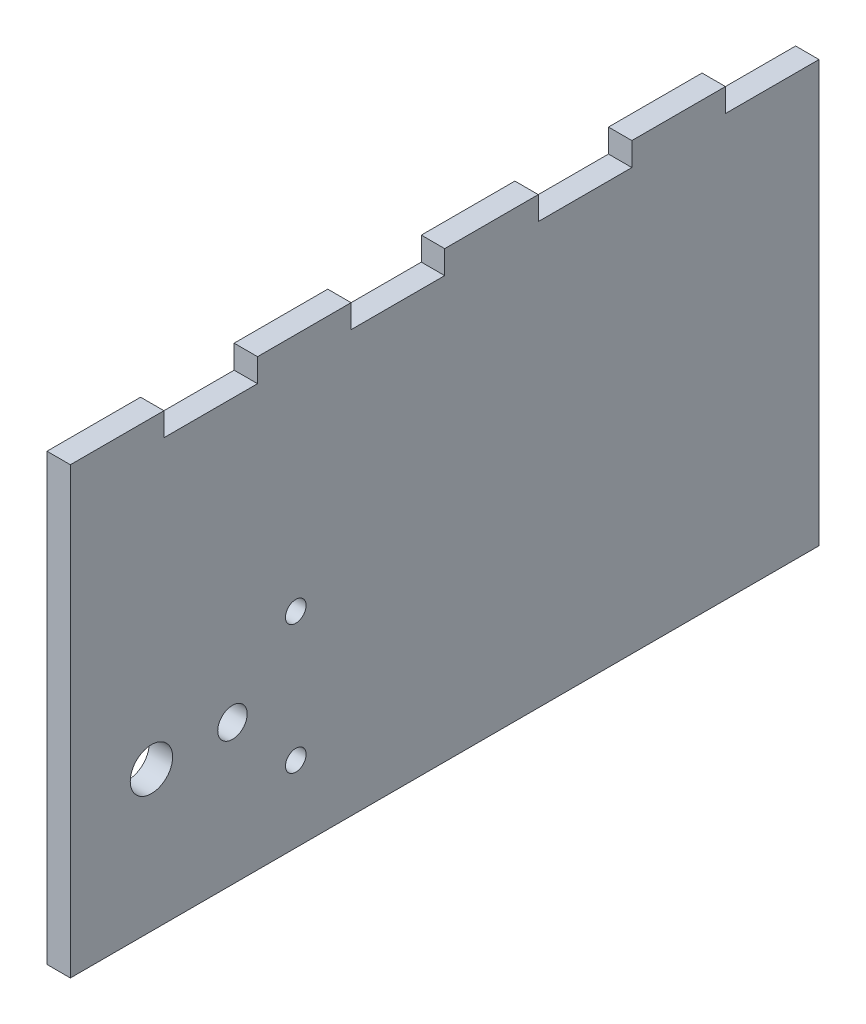
ISO-10303-21;
HEADER;
FILE_DESCRIPTION(('STEP AP214'),'2;1');
FILE_NAME('part.step','',(''),(''),'','','');
FILE_SCHEMA(('AUTOMOTIVE_DESIGN { 1 0 10303 214 1 1 1 1 }'));
ENDSEC;
DATA;
#1=APPLICATION_CONTEXT('core data for automotive mechanical design processes');
#2=APPLICATION_PROTOCOL_DEFINITION('international standard','automotive_design',2000,#1);
#3=PRODUCT_CONTEXT('',#1,'mechanical');
#4=PRODUCT('Part','Part','',(#3));
#5=PRODUCT_RELATED_PRODUCT_CATEGORY('part','',(#4));
#6=PRODUCT_DEFINITION_FORMATION('','',#4);
#7=PRODUCT_DEFINITION_CONTEXT('part definition',#1,'design');
#8=PRODUCT_DEFINITION('design','',#6,#7);
#9=PRODUCT_DEFINITION_SHAPE('','',#8);
#10=(LENGTH_UNIT() NAMED_UNIT(*) SI_UNIT(.MILLI.,.METRE.));
#11=(NAMED_UNIT(*) PLANE_ANGLE_UNIT() SI_UNIT($,.RADIAN.));
#12=(NAMED_UNIT(*) SI_UNIT($,.STERADIAN.) SOLID_ANGLE_UNIT());
#13=UNCERTAINTY_MEASURE_WITH_UNIT(LENGTH_MEASURE(1.E-05),#10,'distance_accuracy_value','');
#14=(GEOMETRIC_REPRESENTATION_CONTEXT(3) GLOBAL_UNCERTAINTY_ASSIGNED_CONTEXT((#13)) GLOBAL_UNIT_ASSIGNED_CONTEXT((#10,
#11,#12)) REPRESENTATION_CONTEXT('',''));
#15=CARTESIAN_POINT('',(0.,0.,0.));
#16=DIRECTION('',(0.,0.,1.));
#17=DIRECTION('',(1.,0.,0.));
#18=AXIS2_PLACEMENT_3D('',#15,#16,#17);
#19=CARTESIAN_POINT('',(3.175,0.,-101.6));
#20=DIRECTION('',(0.,1.,0.));
#21=DIRECTION('',(0.,0.,1.));
#22=AXIS2_PLACEMENT_3D('',#19,#20,#21);
#23=PLANE('',#22);
#24=DIRECTION('',(0.,0.,-1.));
#25=VECTOR('',#24,1.);
#26=CARTESIAN_POINT('',(0.,0.,-101.6));
#27=LINE('',#26,#25);
#28=CARTESIAN_POINT('',(0.,0.,0.));
#29=VERTEX_POINT('',#28);
#30=CARTESIAN_POINT('',(0.,0.,-101.6));
#31=VERTEX_POINT('',#30);
#32=EDGE_CURVE('E190',#29,#31,#27,.T.);
#33=ORIENTED_EDGE('',*,*,#32,.T.);
#34=DIRECTION('',(-1.,0.,0.));
#35=VECTOR('',#34,1.);
#36=CARTESIAN_POINT('',(3.175,0.,-101.6));
#37=LINE('',#36,#35);
#38=CARTESIAN_POINT('',(3.175,0.,-101.6));
#39=VERTEX_POINT('',#38);
#40=EDGE_CURVE('E11',#39,#31,#37,.T.);
#41=ORIENTED_EDGE('',*,*,#40,.F.);
#42=DIRECTION('',(0.,0.,-1.));
#43=VECTOR('',#42,1.);
#44=CARTESIAN_POINT('',(3.175,0.,-101.6));
#45=LINE('',#44,#43);
#46=CARTESIAN_POINT('',(3.175,0.,0.));
#47=VERTEX_POINT('',#46);
#48=EDGE_CURVE('E225',#47,#39,#45,.T.);
#49=ORIENTED_EDGE('',*,*,#48,.F.);
#50=DIRECTION('',(-1.,0.,0.));
#51=VECTOR('',#50,1.);
#52=CARTESIAN_POINT('',(3.175,0.,0.));
#53=LINE('',#52,#51);
#54=EDGE_CURVE('E186',#47,#29,#53,.T.);
#55=ORIENTED_EDGE('',*,*,#54,.T.);
#56=EDGE_LOOP('',(#33,#41,#49,#55));
#57=FACE_BOUND('',#56,.T.);
#58=ADVANCED_FACE('F34',(#57),#23,.F.);
#59=CARTESIAN_POINT('',(3.175,57.15,-101.6));
#60=DIRECTION('',(0.,0.,1.));
#61=DIRECTION('',(0.,-1.,0.));
#62=AXIS2_PLACEMENT_3D('',#59,#60,#61);
#63=PLANE('',#62);
#64=DIRECTION('',(0.,1.,0.));
#65=VECTOR('',#64,1.);
#66=CARTESIAN_POINT('',(0.,57.15,-101.6));
#67=LINE('',#66,#65);
#68=CARTESIAN_POINT('',(0.,57.15,-101.6));
#69=VERTEX_POINT('',#68);
#70=EDGE_CURVE('E193',#31,#69,#67,.T.);
#71=ORIENTED_EDGE('',*,*,#70,.T.);
#72=DIRECTION('',(-1.,0.,0.));
#73=VECTOR('',#72,1.);
#74=CARTESIAN_POINT('',(3.175,57.15,-101.6));
#75=LINE('',#74,#73);
#76=CARTESIAN_POINT('',(3.175,57.15,-101.6));
#77=VERTEX_POINT('',#76);
#78=EDGE_CURVE('E42',#77,#69,#75,.T.);
#79=ORIENTED_EDGE('',*,*,#78,.F.);
#80=DIRECTION('',(0.,1.,0.));
#81=VECTOR('',#80,1.);
#82=CARTESIAN_POINT('',(3.175,57.15,-101.6));
#83=LINE('',#82,#81);
#84=EDGE_CURVE('E123',#39,#77,#83,.T.);
#85=ORIENTED_EDGE('',*,*,#84,.F.);
#86=ORIENTED_EDGE('',*,*,#40,.T.);
#87=EDGE_LOOP('',(#71,#79,#85,#86));
#88=FACE_BOUND('',#87,.T.);
#89=ADVANCED_FACE('F335',(#88),#63,.F.);
#90=CARTESIAN_POINT('',(3.175,57.15,-88.9));
#91=DIRECTION('',(0.,-1.,0.));
#92=DIRECTION('',(0.,0.,-1.));
#93=AXIS2_PLACEMENT_3D('',#90,#91,#92);
#94=PLANE('',#93);
#95=DIRECTION('',(0.,0.,1.));
#96=VECTOR('',#95,1.);
#97=CARTESIAN_POINT('',(0.,57.15,-88.9));
#98=LINE('',#97,#96);
#99=CARTESIAN_POINT('',(0.,57.15,-88.9));
#100=VERTEX_POINT('',#99);
#101=EDGE_CURVE('E196',#69,#100,#98,.T.);
#102=ORIENTED_EDGE('',*,*,#101,.T.);
#103=DIRECTION('',(-1.,0.,0.));
#104=VECTOR('',#103,1.);
#105=CARTESIAN_POINT('',(3.175,57.15,-88.9));
#106=LINE('',#105,#104);
#107=CARTESIAN_POINT('',(3.175,57.15,-88.9));
#108=VERTEX_POINT('',#107);
#109=EDGE_CURVE('E262',#108,#100,#106,.T.);
#110=ORIENTED_EDGE('',*,*,#109,.F.);
#111=DIRECTION('',(0.,0.,1.));
#112=VECTOR('',#111,1.);
#113=CARTESIAN_POINT('',(3.175,57.15,-88.9));
#114=LINE('',#113,#112);
#115=EDGE_CURVE('E270',#77,#108,#114,.T.);
#116=ORIENTED_EDGE('',*,*,#115,.F.);
#117=ORIENTED_EDGE('',*,*,#78,.T.);
#118=EDGE_LOOP('',(#102,#110,#116,#117));
#119=FACE_BOUND('',#118,.T.);
#120=ADVANCED_FACE('F268',(#119),#94,.F.);
#121=CARTESIAN_POINT('',(3.175,60.325,-88.9));
#122=DIRECTION('',(0.,0.,1.));
#123=DIRECTION('',(1.,0.,0.));
#124=AXIS2_PLACEMENT_3D('',#121,#122,#123);
#125=PLANE('',#124);
#126=DIRECTION('',(0.,1.,0.));
#127=VECTOR('',#126,1.);
#128=CARTESIAN_POINT('',(0.,60.325,-88.9));
#129=LINE('',#128,#127);
#130=CARTESIAN_POINT('',(0.,60.325,-88.9));
#131=VERTEX_POINT('',#130);
#132=EDGE_CURVE('E198',#100,#131,#129,.T.);
#133=ORIENTED_EDGE('',*,*,#132,.T.);
#134=DIRECTION('',(-1.,0.,0.));
#135=VECTOR('',#134,1.);
#136=CARTESIAN_POINT('',(3.175,60.325,-88.9));
#137=LINE('',#136,#135);
#138=CARTESIAN_POINT('',(3.175,60.325,-88.9));
#139=VERTEX_POINT('',#138);
#140=EDGE_CURVE('E259',#139,#131,#137,.T.);
#141=ORIENTED_EDGE('',*,*,#140,.F.);
#142=DIRECTION('',(0.,1.,0.));
#143=VECTOR('',#142,1.);
#144=CARTESIAN_POINT('',(3.175,60.325,-88.9));
#145=LINE('',#144,#143);
#146=EDGE_CURVE('E288',#108,#139,#145,.T.);
#147=ORIENTED_EDGE('',*,*,#146,.F.);
#148=ORIENTED_EDGE('',*,*,#109,.T.);
#149=EDGE_LOOP('',(#133,#141,#147,#148));
#150=FACE_BOUND('',#149,.T.);
#151=ADVANCED_FACE('F279',(#150),#125,.F.);
#152=CARTESIAN_POINT('',(3.175,60.325,-76.2));
#153=DIRECTION('',(0.,-1.,0.));
#154=DIRECTION('',(0.,0.,-1.));
#155=AXIS2_PLACEMENT_3D('',#152,#153,#154);
#156=PLANE('',#155);
#157=DIRECTION('',(0.,0.,1.));
#158=VECTOR('',#157,1.);
#159=CARTESIAN_POINT('',(0.,60.325,-76.2));
#160=LINE('',#159,#158);
#161=CARTESIAN_POINT('',(0.,60.325,-76.2));
#162=VERTEX_POINT('',#161);
#163=EDGE_CURVE('E200',#131,#162,#160,.T.);
#164=ORIENTED_EDGE('',*,*,#163,.T.);
#165=DIRECTION('',(-1.,0.,0.));
#166=VECTOR('',#165,1.);
#167=CARTESIAN_POINT('',(3.175,60.325,-76.2));
#168=LINE('',#167,#166);
#169=CARTESIAN_POINT('',(3.175,60.325,-76.2));
#170=VERTEX_POINT('',#169);
#171=EDGE_CURVE('E256',#170,#162,#168,.T.);
#172=ORIENTED_EDGE('',*,*,#171,.F.);
#173=DIRECTION('',(0.,0.,1.));
#174=VECTOR('',#173,1.);
#175=CARTESIAN_POINT('',(3.175,60.325,-76.2));
#176=LINE('',#175,#174);
#177=EDGE_CURVE('E285',#139,#170,#176,.T.);
#178=ORIENTED_EDGE('',*,*,#177,.F.);
#179=ORIENTED_EDGE('',*,*,#140,.T.);
#180=EDGE_LOOP('',(#164,#172,#178,#179));
#181=FACE_BOUND('',#180,.T.);
#182=ADVANCED_FACE('F283',(#181),#156,.F.);
#183=CARTESIAN_POINT('',(3.175,57.15,-76.2));
#184=DIRECTION('',(0.,0.,-1.));
#185=DIRECTION('',(-1.,0.,0.));
#186=AXIS2_PLACEMENT_3D('',#183,#184,#185);
#187=PLANE('',#186);
#188=DIRECTION('',(0.,-1.,0.));
#189=VECTOR('',#188,1.);
#190=CARTESIAN_POINT('',(0.,57.15,-76.2));
#191=LINE('',#190,#189);
#192=CARTESIAN_POINT('',(0.,57.15,-76.2));
#193=VERTEX_POINT('',#192);
#194=EDGE_CURVE('E202',#162,#193,#191,.T.);
#195=ORIENTED_EDGE('',*,*,#194,.T.);
#196=DIRECTION('',(-1.,0.,0.));
#197=VECTOR('',#196,1.);
#198=CARTESIAN_POINT('',(3.175,57.15,-76.2));
#199=LINE('',#198,#197);
#200=CARTESIAN_POINT('',(3.175,57.15,-76.2));
#201=VERTEX_POINT('',#200);
#202=EDGE_CURVE('E253',#201,#193,#199,.T.);
#203=ORIENTED_EDGE('',*,*,#202,.F.);
#204=DIRECTION('',(0.,-1.,0.));
#205=VECTOR('',#204,1.);
#206=CARTESIAN_POINT('',(3.175,57.15,-76.2));
#207=LINE('',#206,#205);
#208=EDGE_CURVE('E287',#170,#201,#207,.T.);
#209=ORIENTED_EDGE('',*,*,#208,.F.);
#210=ORIENTED_EDGE('',*,*,#171,.T.);
#211=EDGE_LOOP('',(#195,#203,#209,#210));
#212=FACE_BOUND('',#211,.T.);
#213=ADVANCED_FACE('F348',(#212),#187,.F.);
#214=CARTESIAN_POINT('',(3.175,57.15,-63.5));
#215=DIRECTION('',(0.,-1.,0.));
#216=DIRECTION('',(0.,0.,-1.));
#217=AXIS2_PLACEMENT_3D('',#214,#215,#216);
#218=PLANE('',#217);
#219=DIRECTION('',(0.,0.,1.));
#220=VECTOR('',#219,1.);
#221=CARTESIAN_POINT('',(0.,57.15,-63.5));
#222=LINE('',#221,#220);
#223=CARTESIAN_POINT('',(0.,57.15,-63.5));
#224=VERTEX_POINT('',#223);
#225=EDGE_CURVE('E204',#193,#224,#222,.T.);
#226=ORIENTED_EDGE('',*,*,#225,.T.);
#227=DIRECTION('',(-1.,0.,0.));
#228=VECTOR('',#227,1.);
#229=CARTESIAN_POINT('',(3.175,57.15,-63.5));
#230=LINE('',#229,#228);
#231=CARTESIAN_POINT('',(3.175,57.15,-63.5));
#232=VERTEX_POINT('',#231);
#233=EDGE_CURVE('E250',#232,#224,#230,.T.);
#234=ORIENTED_EDGE('',*,*,#233,.F.);
#235=DIRECTION('',(0.,0.,1.));
#236=VECTOR('',#235,1.);
#237=CARTESIAN_POINT('',(3.175,57.15,-63.5));
#238=LINE('',#237,#236);
#239=EDGE_CURVE('E290',#201,#232,#238,.T.);
#240=ORIENTED_EDGE('',*,*,#239,.F.);
#241=ORIENTED_EDGE('',*,*,#202,.T.);
#242=EDGE_LOOP('',(#226,#234,#240,#241));
#243=FACE_BOUND('',#242,.T.);
#244=ADVANCED_FACE('F351',(#243),#218,.F.);
#245=CARTESIAN_POINT('',(3.175,60.325,-63.5));
#246=DIRECTION('',(0.,0.,1.));
#247=DIRECTION('',(1.,0.,0.));
#248=AXIS2_PLACEMENT_3D('',#245,#246,#247);
#249=PLANE('',#248);
#250=DIRECTION('',(0.,1.,0.));
#251=VECTOR('',#250,1.);
#252=CARTESIAN_POINT('',(0.,60.325,-63.5));
#253=LINE('',#252,#251);
#254=CARTESIAN_POINT('',(0.,60.325,-63.5));
#255=VERTEX_POINT('',#254);
#256=EDGE_CURVE('E206',#224,#255,#253,.T.);
#257=ORIENTED_EDGE('',*,*,#256,.T.);
#258=DIRECTION('',(-1.,0.,0.));
#259=VECTOR('',#258,1.);
#260=CARTESIAN_POINT('',(3.175,60.325,-63.5));
#261=LINE('',#260,#259);
#262=CARTESIAN_POINT('',(3.175,60.325,-63.5));
#263=VERTEX_POINT('',#262);
#264=EDGE_CURVE('E247',#263,#255,#261,.T.);
#265=ORIENTED_EDGE('',*,*,#264,.F.);
#266=DIRECTION('',(0.,1.,0.));
#267=VECTOR('',#266,1.);
#268=CARTESIAN_POINT('',(3.175,60.325,-63.5));
#269=LINE('',#268,#267);
#270=EDGE_CURVE('E296',#232,#263,#269,.T.);
#271=ORIENTED_EDGE('',*,*,#270,.F.);
#272=ORIENTED_EDGE('',*,*,#233,.T.);
#273=EDGE_LOOP('',(#257,#265,#271,#272));
#274=FACE_BOUND('',#273,.T.);
#275=ADVANCED_FACE('F355',(#274),#249,.F.);
#276=CARTESIAN_POINT('',(3.175,60.325,-50.8));
#277=DIRECTION('',(0.,-1.,0.));
#278=DIRECTION('',(0.,0.,-1.));
#279=AXIS2_PLACEMENT_3D('',#276,#277,#278);
#280=PLANE('',#279);
#281=DIRECTION('',(0.,0.,1.));
#282=VECTOR('',#281,1.);
#283=CARTESIAN_POINT('',(0.,60.325,-50.8));
#284=LINE('',#283,#282);
#285=CARTESIAN_POINT('',(0.,60.325,-50.8));
#286=VERTEX_POINT('',#285);
#287=EDGE_CURVE('E208',#255,#286,#284,.T.);
#288=ORIENTED_EDGE('',*,*,#287,.T.);
#289=DIRECTION('',(-1.,0.,0.));
#290=VECTOR('',#289,1.);
#291=CARTESIAN_POINT('',(3.175,60.325,-50.8));
#292=LINE('',#291,#290);
#293=CARTESIAN_POINT('',(3.175,60.325,-50.8));
#294=VERTEX_POINT('',#293);
#295=EDGE_CURVE('E244',#294,#286,#292,.T.);
#296=ORIENTED_EDGE('',*,*,#295,.F.);
#297=DIRECTION('',(0.,0.,1.));
#298=VECTOR('',#297,1.);
#299=CARTESIAN_POINT('',(3.175,60.325,-50.8));
#300=LINE('',#299,#298);
#301=EDGE_CURVE('E298',#263,#294,#300,.T.);
#302=ORIENTED_EDGE('',*,*,#301,.F.);
#303=ORIENTED_EDGE('',*,*,#264,.T.);
#304=EDGE_LOOP('',(#288,#296,#302,#303));
#305=FACE_BOUND('',#304,.T.);
#306=ADVANCED_FACE('F359',(#305),#280,.F.);
#307=CARTESIAN_POINT('',(3.175,57.15,-50.8));
#308=DIRECTION('',(0.,0.,-1.));
#309=DIRECTION('',(-1.,0.,0.));
#310=AXIS2_PLACEMENT_3D('',#307,#308,#309);
#311=PLANE('',#310);
#312=DIRECTION('',(0.,-1.,0.));
#313=VECTOR('',#312,1.);
#314=CARTESIAN_POINT('',(0.,57.15,-50.8));
#315=LINE('',#314,#313);
#316=CARTESIAN_POINT('',(0.,57.15,-50.8));
#317=VERTEX_POINT('',#316);
#318=EDGE_CURVE('E210',#286,#317,#315,.T.);
#319=ORIENTED_EDGE('',*,*,#318,.T.);
#320=DIRECTION('',(-1.,0.,0.));
#321=VECTOR('',#320,1.);
#322=CARTESIAN_POINT('',(3.175,57.15,-50.8));
#323=LINE('',#322,#321);
#324=CARTESIAN_POINT('',(3.175,57.15,-50.8));
#325=VERTEX_POINT('',#324);
#326=EDGE_CURVE('E241',#325,#317,#323,.T.);
#327=ORIENTED_EDGE('',*,*,#326,.F.);
#328=DIRECTION('',(0.,-1.,0.));
#329=VECTOR('',#328,1.);
#330=CARTESIAN_POINT('',(3.175,57.15,-50.8));
#331=LINE('',#330,#329);
#332=EDGE_CURVE('E300',#294,#325,#331,.T.);
#333=ORIENTED_EDGE('',*,*,#332,.F.);
#334=ORIENTED_EDGE('',*,*,#295,.T.);
#335=EDGE_LOOP('',(#319,#327,#333,#334));
#336=FACE_BOUND('',#335,.T.);
#337=ADVANCED_FACE('F363',(#336),#311,.F.);
#338=CARTESIAN_POINT('',(3.175,57.15,-38.1));
#339=DIRECTION('',(0.,-1.,0.));
#340=DIRECTION('',(0.,0.,-1.));
#341=AXIS2_PLACEMENT_3D('',#338,#339,#340);
#342=PLANE('',#341);
#343=DIRECTION('',(0.,0.,1.));
#344=VECTOR('',#343,1.);
#345=CARTESIAN_POINT('',(0.,57.15,-38.1));
#346=LINE('',#345,#344);
#347=CARTESIAN_POINT('',(0.,57.15,-38.1));
#348=VERTEX_POINT('',#347);
#349=EDGE_CURVE('E212',#317,#348,#346,.T.);
#350=ORIENTED_EDGE('',*,*,#349,.T.);
#351=DIRECTION('',(-1.,0.,0.));
#352=VECTOR('',#351,1.);
#353=CARTESIAN_POINT('',(3.175,57.15,-38.1));
#354=LINE('',#353,#352);
#355=CARTESIAN_POINT('',(3.175,57.15,-38.1));
#356=VERTEX_POINT('',#355);
#357=EDGE_CURVE('E238',#356,#348,#354,.T.);
#358=ORIENTED_EDGE('',*,*,#357,.F.);
#359=DIRECTION('',(0.,0.,1.));
#360=VECTOR('',#359,1.);
#361=CARTESIAN_POINT('',(3.175,57.15,-38.1));
#362=LINE('',#361,#360);
#363=EDGE_CURVE('E302',#325,#356,#362,.T.);
#364=ORIENTED_EDGE('',*,*,#363,.F.);
#365=ORIENTED_EDGE('',*,*,#326,.T.);
#366=EDGE_LOOP('',(#350,#358,#364,#365));
#367=FACE_BOUND('',#366,.T.);
#368=ADVANCED_FACE('F367',(#367),#342,.F.);
#369=CARTESIAN_POINT('',(3.175,60.325,-38.1));
#370=DIRECTION('',(0.,0.,1.));
#371=DIRECTION('',(1.,0.,0.));
#372=AXIS2_PLACEMENT_3D('',#369,#370,#371);
#373=PLANE('',#372);
#374=DIRECTION('',(0.,1.,0.));
#375=VECTOR('',#374,1.);
#376=CARTESIAN_POINT('',(0.,60.325,-38.1));
#377=LINE('',#376,#375);
#378=CARTESIAN_POINT('',(0.,60.325,-38.1));
#379=VERTEX_POINT('',#378);
#380=EDGE_CURVE('E214',#348,#379,#377,.T.);
#381=ORIENTED_EDGE('',*,*,#380,.T.);
#382=DIRECTION('',(-1.,0.,0.));
#383=VECTOR('',#382,1.);
#384=CARTESIAN_POINT('',(3.175,60.325,-38.1));
#385=LINE('',#384,#383);
#386=CARTESIAN_POINT('',(3.175,60.325,-38.1));
#387=VERTEX_POINT('',#386);
#388=EDGE_CURVE('E235',#387,#379,#385,.T.);
#389=ORIENTED_EDGE('',*,*,#388,.F.);
#390=DIRECTION('',(0.,1.,0.));
#391=VECTOR('',#390,1.);
#392=CARTESIAN_POINT('',(3.175,60.325,-38.1));
#393=LINE('',#392,#391);
#394=EDGE_CURVE('E304',#356,#387,#393,.T.);
#395=ORIENTED_EDGE('',*,*,#394,.F.);
#396=ORIENTED_EDGE('',*,*,#357,.T.);
#397=EDGE_LOOP('',(#381,#389,#395,#396));
#398=FACE_BOUND('',#397,.T.);
#399=ADVANCED_FACE('F371',(#398),#373,.F.);
#400=CARTESIAN_POINT('',(3.175,60.325,-25.4));
#401=DIRECTION('',(0.,-1.,0.));
#402=DIRECTION('',(0.,0.,-1.));
#403=AXIS2_PLACEMENT_3D('',#400,#401,#402);
#404=PLANE('',#403);
#405=DIRECTION('',(0.,0.,1.));
#406=VECTOR('',#405,1.);
#407=CARTESIAN_POINT('',(0.,60.325,-25.4));
#408=LINE('',#407,#406);
#409=CARTESIAN_POINT('',(0.,60.325,-25.4));
#410=VERTEX_POINT('',#409);
#411=EDGE_CURVE('E216',#379,#410,#408,.T.);
#412=ORIENTED_EDGE('',*,*,#411,.T.);
#413=DIRECTION('',(-1.,0.,0.));
#414=VECTOR('',#413,1.);
#415=CARTESIAN_POINT('',(3.175,60.325,-25.4));
#416=LINE('',#415,#414);
#417=CARTESIAN_POINT('',(3.175,60.325,-25.4));
#418=VERTEX_POINT('',#417);
#419=EDGE_CURVE('E232',#418,#410,#416,.T.);
#420=ORIENTED_EDGE('',*,*,#419,.F.);
#421=DIRECTION('',(0.,0.,1.));
#422=VECTOR('',#421,1.);
#423=CARTESIAN_POINT('',(3.175,60.325,-25.4));
#424=LINE('',#423,#422);
#425=EDGE_CURVE('E306',#387,#418,#424,.T.);
#426=ORIENTED_EDGE('',*,*,#425,.F.);
#427=ORIENTED_EDGE('',*,*,#388,.T.);
#428=EDGE_LOOP('',(#412,#420,#426,#427));
#429=FACE_BOUND('',#428,.T.);
#430=ADVANCED_FACE('F375',(#429),#404,.F.);
#431=CARTESIAN_POINT('',(3.175,57.15,-25.4));
#432=DIRECTION('',(0.,0.,-1.));
#433=DIRECTION('',(-1.,0.,0.));
#434=AXIS2_PLACEMENT_3D('',#431,#432,#433);
#435=PLANE('',#434);
#436=DIRECTION('',(0.,-1.,0.));
#437=VECTOR('',#436,1.);
#438=CARTESIAN_POINT('',(0.,57.15,-25.4));
#439=LINE('',#438,#437);
#440=CARTESIAN_POINT('',(0.,57.15,-25.4));
#441=VERTEX_POINT('',#440);
#442=EDGE_CURVE('E218',#410,#441,#439,.T.);
#443=ORIENTED_EDGE('',*,*,#442,.T.);
#444=DIRECTION('',(-1.,0.,0.));
#445=VECTOR('',#444,1.);
#446=CARTESIAN_POINT('',(3.175,57.15,-25.4));
#447=LINE('',#446,#445);
#448=CARTESIAN_POINT('',(3.175,57.15,-25.4));
#449=VERTEX_POINT('',#448);
#450=EDGE_CURVE('E229',#449,#441,#447,.T.);
#451=ORIENTED_EDGE('',*,*,#450,.F.);
#452=DIRECTION('',(0.,-1.,0.));
#453=VECTOR('',#452,1.);
#454=CARTESIAN_POINT('',(3.175,57.15,-25.4));
#455=LINE('',#454,#453);
#456=EDGE_CURVE('E308',#418,#449,#455,.T.);
#457=ORIENTED_EDGE('',*,*,#456,.F.);
#458=ORIENTED_EDGE('',*,*,#419,.T.);
#459=EDGE_LOOP('',(#443,#451,#457,#458));
#460=FACE_BOUND('',#459,.T.);
#461=ADVANCED_FACE('F314',(#460),#435,.F.);
#462=CARTESIAN_POINT('',(3.175,57.15,-12.7));
#463=DIRECTION('',(0.,-1.,0.));
#464=DIRECTION('',(0.,0.,-1.));
#465=AXIS2_PLACEMENT_3D('',#462,#463,#464);
#466=PLANE('',#465);
#467=DIRECTION('',(0.,0.,1.));
#468=VECTOR('',#467,1.);
#469=CARTESIAN_POINT('',(0.,57.15,-12.7));
#470=LINE('',#469,#468);
#471=CARTESIAN_POINT('',(0.,57.15,-12.7));
#472=VERTEX_POINT('',#471);
#473=EDGE_CURVE('E220',#441,#472,#470,.T.);
#474=ORIENTED_EDGE('',*,*,#473,.T.);
#475=DIRECTION('',(-1.,0.,0.));
#476=VECTOR('',#475,1.);
#477=CARTESIAN_POINT('',(3.175,57.15,-12.7));
#478=LINE('',#477,#476);
#479=CARTESIAN_POINT('',(3.175,57.15,-12.7));
#480=VERTEX_POINT('',#479);
#481=EDGE_CURVE('E181',#480,#472,#478,.T.);
#482=ORIENTED_EDGE('',*,*,#481,.F.);
#483=DIRECTION('',(0.,0.,1.));
#484=VECTOR('',#483,1.);
#485=CARTESIAN_POINT('',(3.175,57.15,-12.7));
#486=LINE('',#485,#484);
#487=EDGE_CURVE('E172',#449,#480,#486,.T.);
#488=ORIENTED_EDGE('',*,*,#487,.F.);
#489=ORIENTED_EDGE('',*,*,#450,.T.);
#490=EDGE_LOOP('',(#474,#482,#488,#489));
#491=FACE_BOUND('',#490,.T.);
#492=ADVANCED_FACE('F318',(#491),#466,.F.);
#493=CARTESIAN_POINT('',(3.175,60.325,-12.7));
#494=DIRECTION('',(0.,0.,1.));
#495=DIRECTION('',(1.,0.,0.));
#496=AXIS2_PLACEMENT_3D('',#493,#494,#495);
#497=PLANE('',#496);
#498=DIRECTION('',(0.,1.,0.));
#499=VECTOR('',#498,1.);
#500=CARTESIAN_POINT('',(0.,60.325,-12.7));
#501=LINE('',#500,#499);
#502=CARTESIAN_POINT('',(0.,60.325,-12.7));
#503=VERTEX_POINT('',#502);
#504=EDGE_CURVE('E180',#472,#503,#501,.T.);
#505=ORIENTED_EDGE('',*,*,#504,.T.);
#506=DIRECTION('',(-1.,0.,0.));
#507=VECTOR('',#506,1.);
#508=CARTESIAN_POINT('',(3.175,60.325,-12.7));
#509=LINE('',#508,#507);
#510=CARTESIAN_POINT('',(3.175,60.325,-12.7));
#511=VERTEX_POINT('',#510);
#512=EDGE_CURVE('E177',#511,#503,#509,.T.);
#513=ORIENTED_EDGE('',*,*,#512,.F.);
#514=DIRECTION('',(0.,1.,0.));
#515=VECTOR('',#514,1.);
#516=CARTESIAN_POINT('',(3.175,60.325,-12.7));
#517=LINE('',#516,#515);
#518=EDGE_CURVE('E166',#480,#511,#517,.T.);
#519=ORIENTED_EDGE('',*,*,#518,.F.);
#520=ORIENTED_EDGE('',*,*,#481,.T.);
#521=EDGE_LOOP('',(#505,#513,#519,#520));
#522=FACE_BOUND('',#521,.T.);
#523=ADVANCED_FACE('F178',(#522),#497,.F.);
#524=CARTESIAN_POINT('',(3.175,60.325,0.));
#525=DIRECTION('',(0.,-1.,0.));
#526=DIRECTION('',(0.,0.,-1.));
#527=AXIS2_PLACEMENT_3D('',#524,#525,#526);
#528=PLANE('',#527);
#529=DIRECTION('',(0.,0.,1.));
#530=VECTOR('',#529,1.);
#531=CARTESIAN_POINT('',(0.,60.325,0.));
#532=LINE('',#531,#530);
#533=CARTESIAN_POINT('',(0.,60.325,0.));
#534=VERTEX_POINT('',#533);
#535=EDGE_CURVE('E109',#503,#534,#532,.T.);
#536=ORIENTED_EDGE('',*,*,#535,.T.);
#537=DIRECTION('',(-1.,0.,0.));
#538=VECTOR('',#537,1.);
#539=CARTESIAN_POINT('',(3.175,60.325,0.));
#540=LINE('',#539,#538);
#541=CARTESIAN_POINT('',(3.175,60.325,0.));
#542=VERTEX_POINT('',#541);
#543=EDGE_CURVE('E182',#542,#534,#540,.T.);
#544=ORIENTED_EDGE('',*,*,#543,.F.);
#545=DIRECTION('',(0.,0.,1.));
#546=VECTOR('',#545,1.);
#547=CARTESIAN_POINT('',(3.175,60.325,0.));
#548=LINE('',#547,#546);
#549=EDGE_CURVE('E170',#511,#542,#548,.T.);
#550=ORIENTED_EDGE('',*,*,#549,.F.);
#551=ORIENTED_EDGE('',*,*,#512,.T.);
#552=EDGE_LOOP('',(#536,#544,#550,#551));
#553=FACE_BOUND('',#552,.T.);
#554=ADVANCED_FACE('F184',(#553),#528,.F.);
#555=CARTESIAN_POINT('',(3.175,0.,0.));
#556=DIRECTION('',(0.,0.,-1.));
#557=DIRECTION('',(-1.,0.,0.));
#558=AXIS2_PLACEMENT_3D('',#555,#556,#557);
#559=PLANE('',#558);
#560=DIRECTION('',(0.,-1.,0.));
#561=VECTOR('',#560,1.);
#562=CARTESIAN_POINT('',(0.,0.,0.));
#563=LINE('',#562,#561);
#564=EDGE_CURVE('E115',#534,#29,#563,.T.);
#565=ORIENTED_EDGE('',*,*,#564,.T.);
#566=ORIENTED_EDGE('',*,*,#54,.F.);
#567=DIRECTION('',(0.,-1.,0.));
#568=VECTOR('',#567,1.);
#569=CARTESIAN_POINT('',(3.175,0.,0.));
#570=LINE('',#569,#568);
#571=EDGE_CURVE('E50',#542,#47,#570,.T.);
#572=ORIENTED_EDGE('',*,*,#571,.F.);
#573=ORIENTED_EDGE('',*,*,#543,.T.);
#574=EDGE_LOOP('',(#565,#566,#572,#573));
#575=FACE_BOUND('',#574,.T.);
#576=ADVANCED_FACE('F322',(#575),#559,.F.);
#577=CARTESIAN_POINT('',(3.175,0.,0.));
#578=DIRECTION('',(-1.,0.,0.));
#579=DIRECTION('',(0.,0.,1.));
#580=AXIS2_PLACEMENT_3D('',#577,#578,#579);
#581=PLANE('',#580);
#582=CARTESIAN_POINT('',(3.175,19.05,-11.));
#583=DIRECTION('',(1.,0.,0.));
#584=DIRECTION('',(0.,0.,1.));
#585=AXIS2_PLACEMENT_3D('',#582,#583,#584);
#586=CIRCLE('',#585,2.87699996099999);
#587=CARTESIAN_POINT('',(3.175,19.05,-8.12300003899999));
#588=VERTEX_POINT('',#587);
#589=EDGE_CURVE('E456',#588,#588,#586,.T.);
#590=ORIENTED_EDGE('',*,*,#589,.F.);
#591=EDGE_LOOP('',(#590));
#592=FACE_BOUND('',#591,.T.);
#593=CARTESIAN_POINT('',(3.175,19.05,-22.0000034));
#594=DIRECTION('',(1.,0.,0.));
#595=DIRECTION('',(0.,0.,1.));
#596=AXIS2_PLACEMENT_3D('',#593,#594,#595);
#597=CIRCLE('',#596,1.99999999999998);
#598=CARTESIAN_POINT('',(3.175,19.05,-20.0000034));
#599=VERTEX_POINT('',#598);
#600=EDGE_CURVE('E460',#599,#599,#597,.T.);
#601=ORIENTED_EDGE('',*,*,#600,.F.);
#602=EDGE_LOOP('',(#601));
#603=FACE_BOUND('',#602,.T.);
#604=CARTESIAN_POINT('',(3.175,27.8,-30.59102));
#605=DIRECTION('',(1.,0.,0.));
#606=DIRECTION('',(0.,0.,1.));
#607=AXIS2_PLACEMENT_3D('',#604,#605,#606);
#608=CIRCLE('',#607,1.39999999999999);
#609=CARTESIAN_POINT('',(3.175,27.8,-29.19102));
#610=VERTEX_POINT('',#609);
#611=EDGE_CURVE('E467',#610,#610,#608,.T.);
#612=ORIENTED_EDGE('',*,*,#611,.F.);
#613=EDGE_LOOP('',(#612));
#614=FACE_BOUND('',#613,.T.);
#615=CARTESIAN_POINT('',(3.175,10.3,-30.59102));
#616=DIRECTION('',(1.,0.,0.));
#617=DIRECTION('',(0.,0.,1.));
#618=AXIS2_PLACEMENT_3D('',#615,#616,#617);
#619=CIRCLE('',#618,1.39999999999999);
#620=CARTESIAN_POINT('',(3.175,10.3,-29.19102));
#621=VERTEX_POINT('',#620);
#622=EDGE_CURVE('E194',#621,#621,#619,.T.);
#623=ORIENTED_EDGE('',*,*,#622,.F.);
#624=EDGE_LOOP('',(#623));
#625=FACE_BOUND('',#624,.T.);
#626=ORIENTED_EDGE('',*,*,#48,.T.);
#627=ORIENTED_EDGE('',*,*,#84,.T.);
#628=ORIENTED_EDGE('',*,*,#115,.T.);
#629=ORIENTED_EDGE('',*,*,#146,.T.);
#630=ORIENTED_EDGE('',*,*,#177,.T.);
#631=ORIENTED_EDGE('',*,*,#208,.T.);
#632=ORIENTED_EDGE('',*,*,#239,.T.);
#633=ORIENTED_EDGE('',*,*,#270,.T.);
#634=ORIENTED_EDGE('',*,*,#301,.T.);
#635=ORIENTED_EDGE('',*,*,#332,.T.);
#636=ORIENTED_EDGE('',*,*,#363,.T.);
#637=ORIENTED_EDGE('',*,*,#394,.T.);
#638=ORIENTED_EDGE('',*,*,#425,.T.);
#639=ORIENTED_EDGE('',*,*,#456,.T.);
#640=ORIENTED_EDGE('',*,*,#487,.T.);
#641=ORIENTED_EDGE('',*,*,#518,.T.);
#642=ORIENTED_EDGE('',*,*,#549,.T.);
#643=ORIENTED_EDGE('',*,*,#571,.T.);
#644=EDGE_LOOP('',(#626,#627,#628,#629,#630,#631,#632,#633,#634,#635,#636,#637,#638,#639,#640,
#641,#642,#643));
#645=FACE_BOUND('',#644,.T.);
#646=ADVANCED_FACE('F168',(#592,#603,#614,#625,#645),#581,.F.);
#647=CARTESIAN_POINT('',(0.,0.,0.));
#648=DIRECTION('',(-1.,0.,0.));
#649=DIRECTION('',(0.,0.,1.));
#650=AXIS2_PLACEMENT_3D('',#647,#648,#649);
#651=PLANE('',#650);
#652=CARTESIAN_POINT('',(0.,19.05,-11.));
#653=DIRECTION('',(-1.,0.,0.));
#654=DIRECTION('',(0.,0.,1.));
#655=AXIS2_PLACEMENT_3D('',#652,#653,#654);
#656=CIRCLE('',#655,2.87699996099999);
#657=CARTESIAN_POINT('',(0.,19.05,-8.12300003899999));
#658=VERTEX_POINT('',#657);
#659=EDGE_CURVE('E453',#658,#658,#656,.F.);
#660=ORIENTED_EDGE('',*,*,#659,.T.);
#661=EDGE_LOOP('',(#660));
#662=FACE_BOUND('',#661,.T.);
#663=CARTESIAN_POINT('',(0.,19.05,-22.0000034));
#664=DIRECTION('',(-1.,0.,0.));
#665=DIRECTION('',(0.,0.,1.));
#666=AXIS2_PLACEMENT_3D('',#663,#664,#665);
#667=CIRCLE('',#666,1.99999999999998);
#668=CARTESIAN_POINT('',(0.,19.05,-20.0000034));
#669=VERTEX_POINT('',#668);
#670=EDGE_CURVE('E457',#669,#669,#667,.F.);
#671=ORIENTED_EDGE('',*,*,#670,.T.);
#672=EDGE_LOOP('',(#671));
#673=FACE_BOUND('',#672,.T.);
#674=CARTESIAN_POINT('',(0.,27.8,-30.59102));
#675=DIRECTION('',(-1.,0.,0.));
#676=DIRECTION('',(0.,0.,1.));
#677=AXIS2_PLACEMENT_3D('',#674,#675,#676);
#678=CIRCLE('',#677,1.39999999999999);
#679=CARTESIAN_POINT('',(0.,27.8,-29.19102));
#680=VERTEX_POINT('',#679);
#681=EDGE_CURVE('E465',#680,#680,#678,.F.);
#682=ORIENTED_EDGE('',*,*,#681,.T.);
#683=EDGE_LOOP('',(#682));
#684=FACE_BOUND('',#683,.T.);
#685=CARTESIAN_POINT('',(0.,10.3,-30.59102));
#686=DIRECTION('',(-1.,0.,0.));
#687=DIRECTION('',(0.,0.,1.));
#688=AXIS2_PLACEMENT_3D('',#685,#686,#687);
#689=CIRCLE('',#688,1.39999999999999);
#690=CARTESIAN_POINT('',(0.,10.3,-29.19102));
#691=VERTEX_POINT('',#690);
#692=EDGE_CURVE('E470',#691,#691,#689,.F.);
#693=ORIENTED_EDGE('',*,*,#692,.T.);
#694=EDGE_LOOP('',(#693));
#695=FACE_BOUND('',#694,.T.);
#696=ORIENTED_EDGE('',*,*,#32,.F.);
#697=ORIENTED_EDGE('',*,*,#564,.F.);
#698=ORIENTED_EDGE('',*,*,#535,.F.);
#699=ORIENTED_EDGE('',*,*,#504,.F.);
#700=ORIENTED_EDGE('',*,*,#473,.F.);
#701=ORIENTED_EDGE('',*,*,#442,.F.);
#702=ORIENTED_EDGE('',*,*,#411,.F.);
#703=ORIENTED_EDGE('',*,*,#380,.F.);
#704=ORIENTED_EDGE('',*,*,#349,.F.);
#705=ORIENTED_EDGE('',*,*,#318,.F.);
#706=ORIENTED_EDGE('',*,*,#287,.F.);
#707=ORIENTED_EDGE('',*,*,#256,.F.);
#708=ORIENTED_EDGE('',*,*,#225,.F.);
#709=ORIENTED_EDGE('',*,*,#194,.F.);
#710=ORIENTED_EDGE('',*,*,#163,.F.);
#711=ORIENTED_EDGE('',*,*,#132,.F.);
#712=ORIENTED_EDGE('',*,*,#101,.F.);
#713=ORIENTED_EDGE('',*,*,#70,.F.);
#714=EDGE_LOOP('',(#696,#697,#698,#699,#700,#701,#702,#703,#704,#705,#706,#707,#708,#709,#710,
#711,#712,#713));
#715=FACE_BOUND('',#714,.T.);
#716=ADVANCED_FACE('F274',(#662,#673,#684,#695,#715),#651,.T.);
#717=CARTESIAN_POINT('',(-0.00100000000000013,10.3,-30.59102));
#718=DIRECTION('',(1.,0.,0.));
#719=DIRECTION('',(0.,0.,-1.));
#720=AXIS2_PLACEMENT_3D('',#717,#718,#719);
#721=CYLINDRICAL_SURFACE('',#720,1.39999999999999);
#722=ORIENTED_EDGE('',*,*,#692,.F.);
#723=EDGE_LOOP('',(#722));
#724=FACE_BOUND('',#723,.T.);
#725=ORIENTED_EDGE('',*,*,#622,.T.);
#726=EDGE_LOOP('',(#725));
#727=FACE_BOUND('',#726,.T.);
#728=ADVANCED_FACE('F408',(#724,#727),#721,.F.);
#729=CARTESIAN_POINT('',(-0.00100000000000013,27.8,-30.59102));
#730=DIRECTION('',(1.,0.,0.));
#731=DIRECTION('',(0.,0.,-1.));
#732=AXIS2_PLACEMENT_3D('',#729,#730,#731);
#733=CYLINDRICAL_SURFACE('',#732,1.39999999999999);
#734=ORIENTED_EDGE('',*,*,#681,.F.);
#735=EDGE_LOOP('',(#734));
#736=FACE_BOUND('',#735,.T.);
#737=ORIENTED_EDGE('',*,*,#611,.T.);
#738=EDGE_LOOP('',(#737));
#739=FACE_BOUND('',#738,.T.);
#740=ADVANCED_FACE('F416',(#736,#739),#733,.F.);
#741=CARTESIAN_POINT('',(-0.00100000000000013,19.05,-22.0000034));
#742=DIRECTION('',(1.,0.,0.));
#743=DIRECTION('',(0.,0.,-1.));
#744=AXIS2_PLACEMENT_3D('',#741,#742,#743);
#745=CYLINDRICAL_SURFACE('',#744,1.99999999999998);
#746=ORIENTED_EDGE('',*,*,#670,.F.);
#747=EDGE_LOOP('',(#746));
#748=FACE_BOUND('',#747,.T.);
#749=ORIENTED_EDGE('',*,*,#600,.T.);
#750=EDGE_LOOP('',(#749));
#751=FACE_BOUND('',#750,.T.);
#752=ADVANCED_FACE('F426',(#748,#751),#745,.F.);
#753=CARTESIAN_POINT('',(-0.00100000000000013,19.05,-11.));
#754=DIRECTION('',(1.,0.,0.));
#755=DIRECTION('',(0.,0.,-1.));
#756=AXIS2_PLACEMENT_3D('',#753,#754,#755);
#757=CYLINDRICAL_SURFACE('',#756,2.87699996099999);
#758=ORIENTED_EDGE('',*,*,#659,.F.);
#759=EDGE_LOOP('',(#758));
#760=FACE_BOUND('',#759,.T.);
#761=ORIENTED_EDGE('',*,*,#589,.T.);
#762=EDGE_LOOP('',(#761));
#763=FACE_BOUND('',#762,.T.);
#764=ADVANCED_FACE('F436',(#760,#763),#757,.F.);
#765=CLOSED_SHELL('',(#58,#89,#120,#151,#182,#213,#244,#275,#306,#337,#368,#399,#430,#461,#492,
#523,#554,#576,#646,#716,#728,#740,#752,#764));
#766=MANIFOLD_SOLID_BREP('B2',#765);
#767=ADVANCED_BREP_SHAPE_REPRESENTATION('',(#18,#766),#14);
#768=SHAPE_DEFINITION_REPRESENTATION(#9,#767);
ENDSEC;
END-ISO-10303-21;
